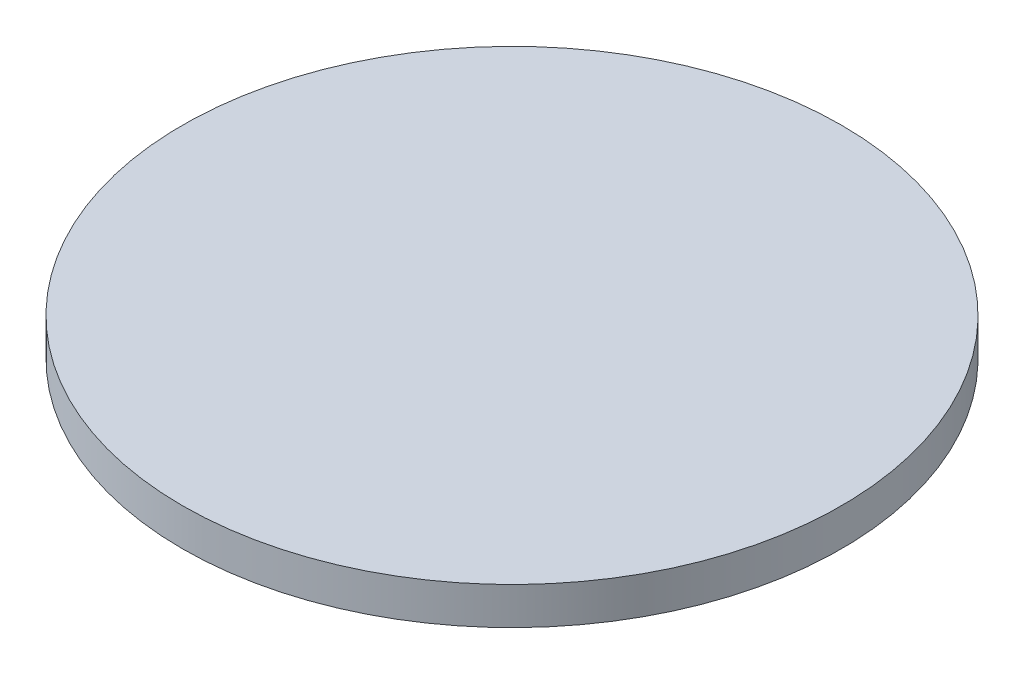
ISO-10303-21;
HEADER;
FILE_DESCRIPTION(('STEP AP214'),'2;1');
FILE_NAME('part.step','',(''),(''),'','','');
FILE_SCHEMA(('AUTOMOTIVE_DESIGN { 1 0 10303 214 1 1 1 1 }'));
ENDSEC;
DATA;
#1=APPLICATION_CONTEXT('core data for automotive mechanical design processes');
#2=APPLICATION_PROTOCOL_DEFINITION('international standard','automotive_design',2000,#1);
#3=PRODUCT_CONTEXT('',#1,'mechanical');
#4=PRODUCT('Part','Part','',(#3));
#5=PRODUCT_RELATED_PRODUCT_CATEGORY('part','',(#4));
#6=PRODUCT_DEFINITION_FORMATION('','',#4);
#7=PRODUCT_DEFINITION_CONTEXT('part definition',#1,'design');
#8=PRODUCT_DEFINITION('design','',#6,#7);
#9=PRODUCT_DEFINITION_SHAPE('','',#8);
#10=(LENGTH_UNIT() NAMED_UNIT(*) SI_UNIT(.MILLI.,.METRE.));
#11=(NAMED_UNIT(*) PLANE_ANGLE_UNIT() SI_UNIT($,.RADIAN.));
#12=(NAMED_UNIT(*) SI_UNIT($,.STERADIAN.) SOLID_ANGLE_UNIT());
#13=UNCERTAINTY_MEASURE_WITH_UNIT(LENGTH_MEASURE(1.E-05),#10,'distance_accuracy_value','');
#14=(GEOMETRIC_REPRESENTATION_CONTEXT(3) GLOBAL_UNCERTAINTY_ASSIGNED_CONTEXT((#13)) GLOBAL_UNIT_ASSIGNED_CONTEXT((#10,
#11,#12)) REPRESENTATION_CONTEXT('',''));
#15=CARTESIAN_POINT('',(0.,0.,0.));
#16=DIRECTION('',(0.,0.,1.));
#17=DIRECTION('',(1.,0.,0.));
#18=AXIS2_PLACEMENT_3D('',#15,#16,#17);
#19=CARTESIAN_POINT('',(0.,1.7,0.));
#20=DIRECTION('',(0.,-1.,0.));
#21=DIRECTION('',(0.,0.,-1.));
#22=AXIS2_PLACEMENT_3D('',#19,#20,#21);
#23=CYLINDRICAL_SURFACE('',#22,15.);
#24=CARTESIAN_POINT('',(0.,1.7,0.));
#25=DIRECTION('',(0.,1.,0.));
#26=DIRECTION('',(0.,0.,1.));
#27=AXIS2_PLACEMENT_3D('',#24,#25,#26);
#28=CIRCLE('',#27,15.);
#29=CARTESIAN_POINT('',(0.,1.7,15.));
#30=VERTEX_POINT('',#29);
#31=EDGE_CURVE('E10',#30,#30,#28,.T.);
#32=ORIENTED_EDGE('',*,*,#31,.F.);
#33=EDGE_LOOP('',(#32));
#34=FACE_BOUND('',#33,.T.);
#35=CARTESIAN_POINT('',(0.,0.,0.));
#36=DIRECTION('',(0.,1.,0.));
#37=DIRECTION('',(0.,0.,1.));
#38=AXIS2_PLACEMENT_3D('',#35,#36,#37);
#39=CIRCLE('',#38,15.);
#40=CARTESIAN_POINT('',(0.,0.,15.));
#41=VERTEX_POINT('',#40);
#42=EDGE_CURVE('E52',#41,#41,#39,.T.);
#43=ORIENTED_EDGE('',*,*,#42,.T.);
#44=EDGE_LOOP('',(#43));
#45=FACE_BOUND('',#44,.T.);
#46=ADVANCED_FACE('F49',(#34,#45),#23,.T.);
#47=CARTESIAN_POINT('',(0.,1.7,0.));
#48=DIRECTION('',(0.,1.,0.));
#49=DIRECTION('',(0.,0.,1.));
#50=AXIS2_PLACEMENT_3D('',#47,#48,#49);
#51=PLANE('',#50);
#52=ORIENTED_EDGE('',*,*,#31,.T.);
#53=EDGE_LOOP('',(#52));
#54=FACE_BOUND('',#53,.T.);
#55=ADVANCED_FACE('F66',(#54),#51,.T.);
#56=CARTESIAN_POINT('',(0.,0.,0.));
#57=DIRECTION('',(0.,1.,0.));
#58=DIRECTION('',(0.,0.,1.));
#59=AXIS2_PLACEMENT_3D('',#56,#57,#58);
#60=PLANE('',#59);
#61=ORIENTED_EDGE('',*,*,#42,.F.);
#62=EDGE_LOOP('',(#61));
#63=FACE_BOUND('',#62,.T.);
#64=ADVANCED_FACE('F64',(#63),#60,.F.);
#65=CLOSED_SHELL('',(#46,#55,#64));
#66=MANIFOLD_SOLID_BREP('B2',#65);
#67=ADVANCED_BREP_SHAPE_REPRESENTATION('',(#18,#66),#14);
#68=SHAPE_DEFINITION_REPRESENTATION(#9,#67);
ENDSEC;
END-ISO-10303-21;
